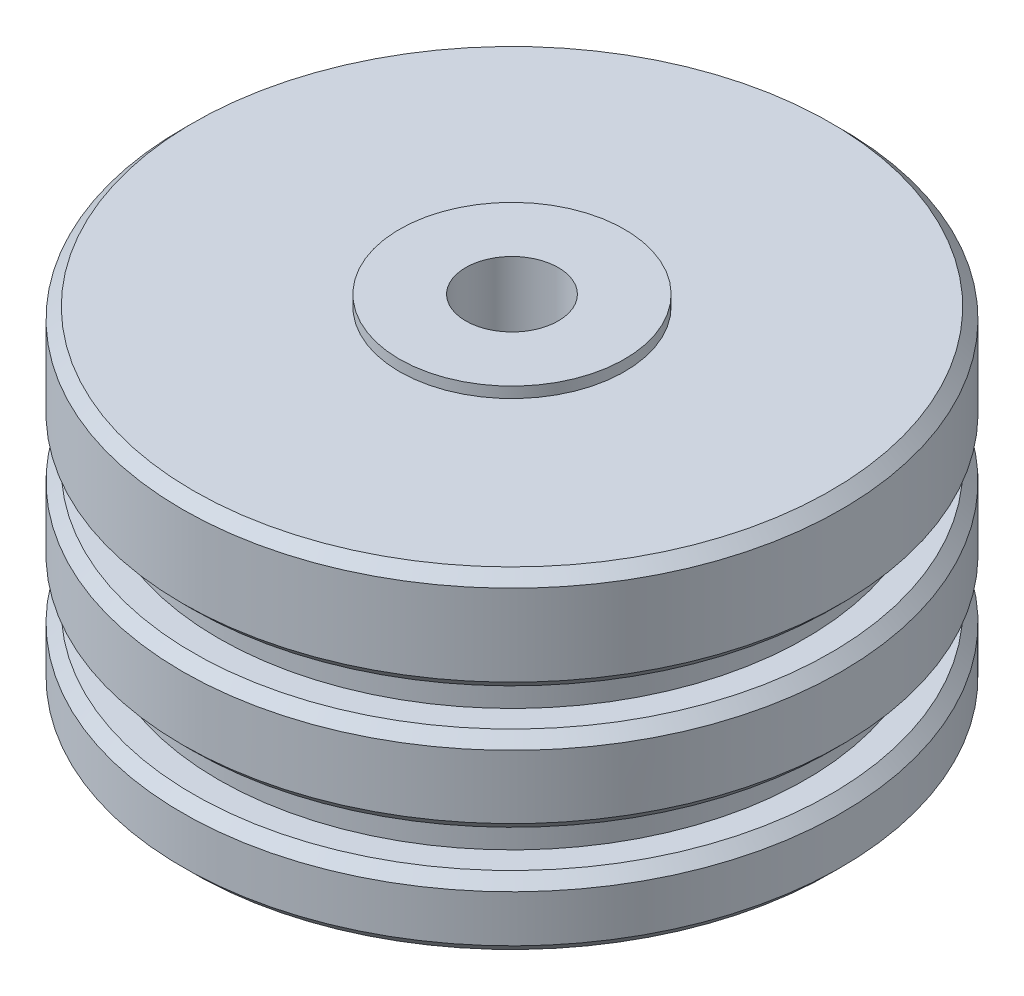
ISO-10303-21;
HEADER;
FILE_DESCRIPTION(('STEP AP214'),'2;1');
FILE_NAME('part.step','',(''),(''),'','','');
FILE_SCHEMA(('AUTOMOTIVE_DESIGN { 1 0 10303 214 1 1 1 1 }'));
ENDSEC;
DATA;
#1=APPLICATION_CONTEXT('core data for automotive mechanical design processes');
#2=APPLICATION_PROTOCOL_DEFINITION('international standard','automotive_design',2000,#1);
#3=PRODUCT_CONTEXT('',#1,'mechanical');
#4=PRODUCT('Part','Part','',(#3));
#5=PRODUCT_RELATED_PRODUCT_CATEGORY('part','',(#4));
#6=PRODUCT_DEFINITION_FORMATION('','',#4);
#7=PRODUCT_DEFINITION_CONTEXT('part definition',#1,'design');
#8=PRODUCT_DEFINITION('design','',#6,#7);
#9=PRODUCT_DEFINITION_SHAPE('','',#8);
#10=(LENGTH_UNIT() NAMED_UNIT(*) SI_UNIT(.MILLI.,.METRE.));
#11=(NAMED_UNIT(*) PLANE_ANGLE_UNIT() SI_UNIT($,.RADIAN.));
#12=(NAMED_UNIT(*) SI_UNIT($,.STERADIAN.) SOLID_ANGLE_UNIT());
#13=UNCERTAINTY_MEASURE_WITH_UNIT(LENGTH_MEASURE(1.E-05),#10,'distance_accuracy_value','');
#14=(GEOMETRIC_REPRESENTATION_CONTEXT(3) GLOBAL_UNCERTAINTY_ASSIGNED_CONTEXT((#13)) GLOBAL_UNIT_ASSIGNED_CONTEXT((#10,
#11,#12)) REPRESENTATION_CONTEXT('',''));
#15=CARTESIAN_POINT('',(0.,0.,0.));
#16=DIRECTION('',(0.,0.,1.));
#17=DIRECTION('',(1.,0.,0.));
#18=AXIS2_PLACEMENT_3D('',#15,#16,#17);
#19=CARTESIAN_POINT('',(0.,24.892,0.));
#20=DIRECTION('',(0.,1.,0.));
#21=DIRECTION('',(0.,0.,1.));
#22=AXIS2_PLACEMENT_3D('',#19,#20,#21);
#23=CYLINDRICAL_SURFACE('',#22,7.9375);
#24=CARTESIAN_POINT('',(0.,0.,0.));
#25=DIRECTION('',(0.,1.,0.));
#26=DIRECTION('',(0.,0.,1.));
#27=AXIS2_PLACEMENT_3D('',#24,#25,#26);
#28=CIRCLE('',#27,7.9375);
#29=CARTESIAN_POINT('',(0.,0.,7.9375));
#30=VERTEX_POINT('',#29);
#31=EDGE_CURVE('E98',#30,#30,#28,.T.);
#32=ORIENTED_EDGE('',*,*,#31,.T.);
#33=EDGE_LOOP('',(#32));
#34=FACE_BOUND('',#33,.T.);
#35=CARTESIAN_POINT('',(0.,0.761999999999999,0.));
#36=DIRECTION('',(0.,1.,0.));
#37=DIRECTION('',(0.,0.,1.));
#38=AXIS2_PLACEMENT_3D('',#35,#36,#37);
#39=CIRCLE('',#38,7.9375);
#40=CARTESIAN_POINT('',(0.,0.761999999999999,7.9375));
#41=VERTEX_POINT('',#40);
#42=EDGE_CURVE('E77',#41,#41,#39,.T.);
#43=ORIENTED_EDGE('',*,*,#42,.F.);
#44=EDGE_LOOP('',(#43));
#45=FACE_BOUND('',#44,.T.);
#46=ADVANCED_FACE('F33',(#34,#45),#23,.T.);
#47=CARTESIAN_POINT('',(0.,0.761999999999999,0.));
#48=DIRECTION('',(0.,-1.,0.));
#49=DIRECTION('',(0.,0.,-1.));
#50=AXIS2_PLACEMENT_3D('',#47,#48,#49);
#51=PLANE('',#50);
#52=CARTESIAN_POINT('',(0.,0.761999999999999,0.));
#53=DIRECTION('',(0.,-1.,0.));
#54=DIRECTION('',(0.,0.,-1.));
#55=AXIS2_PLACEMENT_3D('',#52,#53,#54);
#56=CIRCLE('',#55,22.479);
#57=CARTESIAN_POINT('',(0.,0.761999999999999,-22.479));
#58=VERTEX_POINT('',#57);
#59=EDGE_CURVE('E68',#58,#58,#56,.T.);
#60=ORIENTED_EDGE('',*,*,#59,.T.);
#61=EDGE_LOOP('',(#60));
#62=FACE_BOUND('',#61,.T.);
#63=ORIENTED_EDGE('',*,*,#42,.T.);
#64=EDGE_LOOP('',(#63));
#65=FACE_BOUND('',#64,.T.);
#66=ADVANCED_FACE('F128',(#62,#65),#51,.T.);
#67=CARTESIAN_POINT('',(0.,24.892,0.));
#68=DIRECTION('',(0.,1.,0.));
#69=DIRECTION('',(0.,0.,1.));
#70=AXIS2_PLACEMENT_3D('',#67,#68,#69);
#71=CYLINDRICAL_SURFACE('',#70,23.241);
#72=CARTESIAN_POINT('',(0.,1.52399999999999,0.));
#73=DIRECTION('',(0.,-1.,0.));
#74=DIRECTION('',(0.,0.,-1.));
#75=AXIS2_PLACEMENT_3D('',#72,#73,#74);
#76=CIRCLE('',#75,23.241);
#77=CARTESIAN_POINT('',(0.,1.52399999999999,-23.241));
#78=VERTEX_POINT('',#77);
#79=EDGE_CURVE('E71',#78,#78,#76,.F.);
#80=ORIENTED_EDGE('',*,*,#79,.T.);
#81=EDGE_LOOP('',(#80));
#82=FACE_BOUND('',#81,.T.);
#83=CARTESIAN_POINT('',(0.,4.826,0.));
#84=DIRECTION('',(0.,-1.,0.));
#85=DIRECTION('',(0.,0.,-1.));
#86=AXIS2_PLACEMENT_3D('',#83,#84,#85);
#87=CIRCLE('',#86,23.241);
#88=CARTESIAN_POINT('',(0.,4.826,-23.241));
#89=VERTEX_POINT('',#88);
#90=EDGE_CURVE('E74',#89,#89,#87,.T.);
#91=ORIENTED_EDGE('',*,*,#90,.T.);
#92=EDGE_LOOP('',(#91));
#93=FACE_BOUND('',#92,.T.);
#94=ADVANCED_FACE('F134',(#82,#93),#71,.T.);
#95=CARTESIAN_POINT('',(0.,5.588,0.));
#96=DIRECTION('',(0.,-1.,0.));
#97=DIRECTION('',(0.,0.,-1.));
#98=AXIS2_PLACEMENT_3D('',#95,#96,#97);
#99=PLANE('',#98);
#100=CARTESIAN_POINT('',(0.,5.588,0.));
#101=DIRECTION('',(0.,-1.,0.));
#102=DIRECTION('',(0.,0.,-1.));
#103=AXIS2_PLACEMENT_3D('',#100,#101,#102);
#104=CIRCLE('',#103,22.479);
#105=CARTESIAN_POINT('',(0.,5.588,-22.479));
#106=VERTEX_POINT('',#105);
#107=EDGE_CURVE('E65',#106,#106,#104,.F.);
#108=ORIENTED_EDGE('',*,*,#107,.T.);
#109=EDGE_LOOP('',(#108));
#110=FACE_BOUND('',#109,.T.);
#111=CARTESIAN_POINT('',(0.,5.588,0.));
#112=DIRECTION('',(0.,1.,0.));
#113=DIRECTION('',(0.,0.,1.));
#114=AXIS2_PLACEMENT_3D('',#111,#112,#113);
#115=CIRCLE('',#114,20.701);
#116=CARTESIAN_POINT('',(0.,5.588,20.701));
#117=VERTEX_POINT('',#116);
#118=EDGE_CURVE('E80',#117,#117,#115,.T.);
#119=ORIENTED_EDGE('',*,*,#118,.F.);
#120=EDGE_LOOP('',(#119));
#121=FACE_BOUND('',#120,.T.);
#122=ADVANCED_FACE('F195',(#110,#121),#99,.F.);
#123=CARTESIAN_POINT('',(0.,24.892,0.));
#124=DIRECTION('',(0.,1.,0.));
#125=DIRECTION('',(0.,0.,1.));
#126=AXIS2_PLACEMENT_3D('',#123,#124,#125);
#127=CYLINDRICAL_SURFACE('',#126,20.701);
#128=CARTESIAN_POINT('',(0.,8.226800031,0.));
#129=DIRECTION('',(0.,1.,0.));
#130=DIRECTION('',(0.,0.,1.));
#131=AXIS2_PLACEMENT_3D('',#128,#129,#130);
#132=CIRCLE('',#131,20.701);
#133=CARTESIAN_POINT('',(0.,8.226800031,20.701));
#134=VERTEX_POINT('',#133);
#135=EDGE_CURVE('E83',#134,#134,#132,.T.);
#136=ORIENTED_EDGE('',*,*,#135,.F.);
#137=EDGE_LOOP('',(#136));
#138=FACE_BOUND('',#137,.T.);
#139=ORIENTED_EDGE('',*,*,#118,.T.);
#140=EDGE_LOOP('',(#139));
#141=FACE_BOUND('',#140,.T.);
#142=ADVANCED_FACE('F191',(#138,#141),#127,.T.);
#143=CARTESIAN_POINT('',(0.,8.226800031,0.));
#144=DIRECTION('',(0.,1.,0.));
#145=DIRECTION('',(0.,0.,1.));
#146=AXIS2_PLACEMENT_3D('',#143,#144,#145);
#147=PLANE('',#146);
#148=CARTESIAN_POINT('',(0.,8.226800031,0.));
#149=DIRECTION('',(0.,1.,0.));
#150=DIRECTION('',(0.,0.,1.));
#151=AXIS2_PLACEMENT_3D('',#148,#149,#150);
#152=CIRCLE('',#151,22.479);
#153=CARTESIAN_POINT('',(0.,8.226800031,22.479));
#154=VERTEX_POINT('',#153);
#155=EDGE_CURVE('E56',#154,#154,#152,.F.);
#156=ORIENTED_EDGE('',*,*,#155,.T.);
#157=EDGE_LOOP('',(#156));
#158=FACE_BOUND('',#157,.T.);
#159=ORIENTED_EDGE('',*,*,#135,.T.);
#160=EDGE_LOOP('',(#159));
#161=FACE_BOUND('',#160,.T.);
#162=ADVANCED_FACE('F187',(#158,#161),#147,.F.);
#163=CARTESIAN_POINT('',(0.,24.892,0.));
#164=DIRECTION('',(0.,1.,0.));
#165=DIRECTION('',(0.,0.,1.));
#166=AXIS2_PLACEMENT_3D('',#163,#164,#165);
#167=CYLINDRICAL_SURFACE('',#166,23.241);
#168=CARTESIAN_POINT('',(0.,8.98880003100001,0.));
#169=DIRECTION('',(0.,1.,0.));
#170=DIRECTION('',(0.,0.,1.));
#171=AXIS2_PLACEMENT_3D('',#168,#169,#170);
#172=CIRCLE('',#171,23.241);
#173=CARTESIAN_POINT('',(0.,8.98880003100001,23.241));
#174=VERTEX_POINT('',#173);
#175=EDGE_CURVE('E59',#174,#174,#172,.T.);
#176=ORIENTED_EDGE('',*,*,#175,.T.);
#177=EDGE_LOOP('',(#176));
#178=FACE_BOUND('',#177,.T.);
#179=CARTESIAN_POINT('',(0.,13.464799969,0.));
#180=DIRECTION('',(0.,-1.,0.));
#181=DIRECTION('',(0.,0.,-1.));
#182=AXIS2_PLACEMENT_3D('',#179,#180,#181);
#183=CIRCLE('',#182,23.241);
#184=CARTESIAN_POINT('',(0.,13.464799969,-23.241));
#185=VERTEX_POINT('',#184);
#186=EDGE_CURVE('E62',#185,#185,#183,.T.);
#187=ORIENTED_EDGE('',*,*,#186,.T.);
#188=EDGE_LOOP('',(#187));
#189=FACE_BOUND('',#188,.T.);
#190=ADVANCED_FACE('F183',(#178,#189),#167,.T.);
#191=CARTESIAN_POINT('',(0.,14.226799969,0.));
#192=DIRECTION('',(0.,-1.,0.));
#193=DIRECTION('',(0.,0.,-1.));
#194=AXIS2_PLACEMENT_3D('',#191,#192,#193);
#195=PLANE('',#194);
#196=CARTESIAN_POINT('',(0.,14.226799969,0.));
#197=DIRECTION('',(0.,-1.,0.));
#198=DIRECTION('',(0.,0.,-1.));
#199=AXIS2_PLACEMENT_3D('',#196,#197,#198);
#200=CIRCLE('',#199,22.479);
#201=CARTESIAN_POINT('',(0.,14.226799969,-22.479));
#202=VERTEX_POINT('',#201);
#203=EDGE_CURVE('E53',#202,#202,#200,.F.);
#204=ORIENTED_EDGE('',*,*,#203,.T.);
#205=EDGE_LOOP('',(#204));
#206=FACE_BOUND('',#205,.T.);
#207=CARTESIAN_POINT('',(0.,14.226799969,0.));
#208=DIRECTION('',(0.,1.,0.));
#209=DIRECTION('',(0.,0.,1.));
#210=AXIS2_PLACEMENT_3D('',#207,#208,#209);
#211=CIRCLE('',#210,20.701);
#212=CARTESIAN_POINT('',(0.,14.226799969,20.701));
#213=VERTEX_POINT('',#212);
#214=EDGE_CURVE('E86',#213,#213,#211,.T.);
#215=ORIENTED_EDGE('',*,*,#214,.F.);
#216=EDGE_LOOP('',(#215));
#217=FACE_BOUND('',#216,.T.);
#218=ADVANCED_FACE('F179',(#206,#217),#195,.F.);
#219=CARTESIAN_POINT('',(0.,24.892,0.));
#220=DIRECTION('',(0.,1.,0.));
#221=DIRECTION('',(0.,0.,1.));
#222=AXIS2_PLACEMENT_3D('',#219,#220,#221);
#223=CYLINDRICAL_SURFACE('',#222,20.701);
#224=CARTESIAN_POINT('',(0.,16.8656,0.));
#225=DIRECTION('',(0.,1.,0.));
#226=DIRECTION('',(0.,0.,1.));
#227=AXIS2_PLACEMENT_3D('',#224,#225,#226);
#228=CIRCLE('',#227,20.701);
#229=CARTESIAN_POINT('',(0.,16.8656,20.701));
#230=VERTEX_POINT('',#229);
#231=EDGE_CURVE('E89',#230,#230,#228,.T.);
#232=ORIENTED_EDGE('',*,*,#231,.F.);
#233=EDGE_LOOP('',(#232));
#234=FACE_BOUND('',#233,.T.);
#235=ORIENTED_EDGE('',*,*,#214,.T.);
#236=EDGE_LOOP('',(#235));
#237=FACE_BOUND('',#236,.T.);
#238=ADVANCED_FACE('F174',(#234,#237),#223,.T.);
#239=CARTESIAN_POINT('',(0.,16.8656,0.));
#240=DIRECTION('',(0.,1.,0.));
#241=DIRECTION('',(0.,0.,1.));
#242=AXIS2_PLACEMENT_3D('',#239,#240,#241);
#243=PLANE('',#242);
#244=CARTESIAN_POINT('',(0.,16.8656,0.));
#245=DIRECTION('',(0.,1.,0.));
#246=DIRECTION('',(0.,0.,1.));
#247=AXIS2_PLACEMENT_3D('',#244,#245,#246);
#248=CIRCLE('',#247,22.479);
#249=CARTESIAN_POINT('',(0.,16.8656,22.479));
#250=VERTEX_POINT('',#249);
#251=EDGE_CURVE('E40',#250,#250,#248,.F.);
#252=ORIENTED_EDGE('',*,*,#251,.T.);
#253=EDGE_LOOP('',(#252));
#254=FACE_BOUND('',#253,.T.);
#255=ORIENTED_EDGE('',*,*,#231,.T.);
#256=EDGE_LOOP('',(#255));
#257=FACE_BOUND('',#256,.T.);
#258=ADVANCED_FACE('F167',(#254,#257),#243,.F.);
#259=CARTESIAN_POINT('',(0.,24.892,0.));
#260=DIRECTION('',(0.,1.,0.));
#261=DIRECTION('',(0.,0.,1.));
#262=AXIS2_PLACEMENT_3D('',#259,#260,#261);
#263=CYLINDRICAL_SURFACE('',#262,23.241);
#264=CARTESIAN_POINT('',(0.,17.6276,0.));
#265=DIRECTION('',(0.,1.,0.));
#266=DIRECTION('',(0.,0.,1.));
#267=AXIS2_PLACEMENT_3D('',#264,#265,#266);
#268=CIRCLE('',#267,23.241);
#269=CARTESIAN_POINT('',(0.,17.6276,23.241));
#270=VERTEX_POINT('',#269);
#271=EDGE_CURVE('E44',#270,#270,#268,.T.);
#272=ORIENTED_EDGE('',*,*,#271,.T.);
#273=EDGE_LOOP('',(#272));
#274=FACE_BOUND('',#273,.T.);
#275=CARTESIAN_POINT('',(0.,23.368,0.));
#276=DIRECTION('',(0.,1.,0.));
#277=DIRECTION('',(0.,0.,1.));
#278=AXIS2_PLACEMENT_3D('',#275,#276,#277);
#279=CIRCLE('',#278,23.241);
#280=CARTESIAN_POINT('',(0.,23.368,23.241));
#281=VERTEX_POINT('',#280);
#282=EDGE_CURVE('E48',#281,#281,#279,.F.);
#283=ORIENTED_EDGE('',*,*,#282,.T.);
#284=EDGE_LOOP('',(#283));
#285=FACE_BOUND('',#284,.T.);
#286=ADVANCED_FACE('F125',(#274,#285),#263,.T.);
#287=CARTESIAN_POINT('',(0.,24.13,0.));
#288=DIRECTION('',(0.,1.,0.));
#289=DIRECTION('',(0.,0.,1.));
#290=AXIS2_PLACEMENT_3D('',#287,#288,#289);
#291=PLANE('',#290);
#292=CARTESIAN_POINT('',(0.,24.13,0.));
#293=DIRECTION('',(0.,1.,0.));
#294=DIRECTION('',(0.,0.,1.));
#295=AXIS2_PLACEMENT_3D('',#292,#293,#294);
#296=CIRCLE('',#295,22.479);
#297=CARTESIAN_POINT('',(0.,24.13,22.479));
#298=VERTEX_POINT('',#297);
#299=EDGE_CURVE('E10',#298,#298,#296,.T.);
#300=ORIENTED_EDGE('',*,*,#299,.T.);
#301=EDGE_LOOP('',(#300));
#302=FACE_BOUND('',#301,.T.);
#303=CARTESIAN_POINT('',(0.,24.13,0.));
#304=DIRECTION('',(0.,1.,0.));
#305=DIRECTION('',(0.,0.,1.));
#306=AXIS2_PLACEMENT_3D('',#303,#304,#305);
#307=CIRCLE('',#306,7.9375);
#308=CARTESIAN_POINT('',(0.,24.13,7.9375));
#309=VERTEX_POINT('',#308);
#310=EDGE_CURVE('E92',#309,#309,#307,.T.);
#311=ORIENTED_EDGE('',*,*,#310,.F.);
#312=EDGE_LOOP('',(#311));
#313=FACE_BOUND('',#312,.T.);
#314=ADVANCED_FACE('F119',(#302,#313),#291,.T.);
#315=CARTESIAN_POINT('',(0.,24.892,0.));
#316=DIRECTION('',(0.,1.,0.));
#317=DIRECTION('',(0.,0.,1.));
#318=AXIS2_PLACEMENT_3D('',#315,#316,#317);
#319=CYLINDRICAL_SURFACE('',#318,7.9375);
#320=ORIENTED_EDGE('',*,*,#310,.T.);
#321=EDGE_LOOP('',(#320));
#322=FACE_BOUND('',#321,.T.);
#323=CARTESIAN_POINT('',(0.,24.892,0.));
#324=DIRECTION('',(0.,1.,0.));
#325=DIRECTION('',(0.,0.,1.));
#326=AXIS2_PLACEMENT_3D('',#323,#324,#325);
#327=CIRCLE('',#326,7.9375);
#328=CARTESIAN_POINT('',(0.,24.892,7.9375));
#329=VERTEX_POINT('',#328);
#330=EDGE_CURVE('E95',#329,#329,#327,.T.);
#331=ORIENTED_EDGE('',*,*,#330,.F.);
#332=EDGE_LOOP('',(#331));
#333=FACE_BOUND('',#332,.T.);
#334=ADVANCED_FACE('F114',(#322,#333),#319,.T.);
#335=CARTESIAN_POINT('',(0.,24.892,0.));
#336=DIRECTION('',(0.,-1.,0.));
#337=DIRECTION('',(0.,0.,-1.));
#338=AXIS2_PLACEMENT_3D('',#335,#336,#337);
#339=PLANE('',#338);
#340=CARTESIAN_POINT('',(0.,24.892,0.));
#341=DIRECTION('',(0.,1.,0.));
#342=DIRECTION('',(0.,0.,1.));
#343=AXIS2_PLACEMENT_3D('',#340,#341,#342);
#344=CIRCLE('',#343,3.26389999999999);
#345=CARTESIAN_POINT('',(0.,24.892,3.26389999999999));
#346=VERTEX_POINT('',#345);
#347=EDGE_CURVE('E104',#346,#346,#344,.T.);
#348=ORIENTED_EDGE('',*,*,#347,.F.);
#349=EDGE_LOOP('',(#348));
#350=FACE_BOUND('',#349,.T.);
#351=ORIENTED_EDGE('',*,*,#330,.T.);
#352=EDGE_LOOP('',(#351));
#353=FACE_BOUND('',#352,.T.);
#354=ADVANCED_FACE('F110',(#350,#353),#339,.F.);
#355=CARTESIAN_POINT('',(0.,0.,0.));
#356=DIRECTION('',(0.,1.,0.));
#357=DIRECTION('',(0.,0.,1.));
#358=AXIS2_PLACEMENT_3D('',#355,#356,#357);
#359=PLANE('',#358);
#360=CARTESIAN_POINT('',(0.,0.,0.));
#361=DIRECTION('',(0.,1.,0.));
#362=DIRECTION('',(0.,0.,1.));
#363=AXIS2_PLACEMENT_3D('',#360,#361,#362);
#364=CIRCLE('',#363,3.26389999999999);
#365=CARTESIAN_POINT('',(0.,0.,3.26389999999999));
#366=VERTEX_POINT('',#365);
#367=EDGE_CURVE('E101',#366,#366,#364,.T.);
#368=ORIENTED_EDGE('',*,*,#367,.T.);
#369=EDGE_LOOP('',(#368));
#370=FACE_BOUND('',#369,.T.);
#371=ORIENTED_EDGE('',*,*,#31,.F.);
#372=EDGE_LOOP('',(#371));
#373=FACE_BOUND('',#372,.T.);
#374=ADVANCED_FACE('F113',(#370,#373),#359,.F.);
#375=CARTESIAN_POINT('',(0.,24.892,0.));
#376=DIRECTION('',(0.,1.,0.));
#377=DIRECTION('',(0.,0.,1.));
#378=AXIS2_PLACEMENT_3D('',#375,#376,#377);
#379=CYLINDRICAL_SURFACE('',#378,3.26389999999999);
#380=ORIENTED_EDGE('',*,*,#367,.F.);
#381=EDGE_LOOP('',(#380));
#382=FACE_BOUND('',#381,.T.);
#383=ORIENTED_EDGE('',*,*,#347,.T.);
#384=EDGE_LOOP('',(#383));
#385=FACE_BOUND('',#384,.T.);
#386=ADVANCED_FACE('F108',(#382,#385),#379,.F.);
#387=CARTESIAN_POINT('',(0.,1.52399999999999,0.));
#388=DIRECTION('',(0.,1.,0.));
#389=DIRECTION('',(0.,0.,1.));
#390=AXIS2_PLACEMENT_3D('',#387,#388,#389);
#391=CONICAL_SURFACE('',#390,23.241,0.785398163397448);
#392=ORIENTED_EDGE('',*,*,#59,.F.);
#393=EDGE_LOOP('',(#392));
#394=FACE_BOUND('',#393,.T.);
#395=ORIENTED_EDGE('',*,*,#79,.F.);
#396=EDGE_LOOP('',(#395));
#397=FACE_BOUND('',#396,.T.);
#398=ADVANCED_FACE('F140',(#394,#397),#391,.T.);
#399=CARTESIAN_POINT('',(0.,5.588,0.));
#400=DIRECTION('',(0.,-1.,0.));
#401=DIRECTION('',(0.,0.,-1.));
#402=AXIS2_PLACEMENT_3D('',#399,#400,#401);
#403=CONICAL_SURFACE('',#402,22.479,0.785398163397448);
#404=ORIENTED_EDGE('',*,*,#90,.F.);
#405=EDGE_LOOP('',(#404));
#406=FACE_BOUND('',#405,.T.);
#407=ORIENTED_EDGE('',*,*,#107,.F.);
#408=EDGE_LOOP('',(#407));
#409=FACE_BOUND('',#408,.T.);
#410=ADVANCED_FACE('F143',(#406,#409),#403,.T.);
#411=CARTESIAN_POINT('',(0.,8.98880003100001,0.));
#412=DIRECTION('',(0.,1.,0.));
#413=DIRECTION('',(0.,0.,1.));
#414=AXIS2_PLACEMENT_3D('',#411,#412,#413);
#415=CONICAL_SURFACE('',#414,23.241,0.785398163397453);
#416=ORIENTED_EDGE('',*,*,#155,.F.);
#417=EDGE_LOOP('',(#416));
#418=FACE_BOUND('',#417,.T.);
#419=ORIENTED_EDGE('',*,*,#175,.F.);
#420=EDGE_LOOP('',(#419));
#421=FACE_BOUND('',#420,.T.);
#422=ADVANCED_FACE('F147',(#418,#421),#415,.T.);
#423=CARTESIAN_POINT('',(0.,14.226799969,0.));
#424=DIRECTION('',(0.,-1.,0.));
#425=DIRECTION('',(0.,0.,-1.));
#426=AXIS2_PLACEMENT_3D('',#423,#424,#425);
#427=CONICAL_SURFACE('',#426,22.479,0.785398163397448);
#428=ORIENTED_EDGE('',*,*,#186,.F.);
#429=EDGE_LOOP('',(#428));
#430=FACE_BOUND('',#429,.T.);
#431=ORIENTED_EDGE('',*,*,#203,.F.);
#432=EDGE_LOOP('',(#431));
#433=FACE_BOUND('',#432,.T.);
#434=ADVANCED_FACE('F151',(#430,#433),#427,.T.);
#435=CARTESIAN_POINT('',(0.,17.6276,0.));
#436=DIRECTION('',(0.,1.,0.));
#437=DIRECTION('',(0.,0.,1.));
#438=AXIS2_PLACEMENT_3D('',#435,#436,#437);
#439=CONICAL_SURFACE('',#438,23.241,0.785398163397453);
#440=ORIENTED_EDGE('',*,*,#251,.F.);
#441=EDGE_LOOP('',(#440));
#442=FACE_BOUND('',#441,.T.);
#443=ORIENTED_EDGE('',*,*,#271,.F.);
#444=EDGE_LOOP('',(#443));
#445=FACE_BOUND('',#444,.T.);
#446=ADVANCED_FACE('F154',(#442,#445),#439,.T.);
#447=CARTESIAN_POINT('',(0.,24.13,0.));
#448=DIRECTION('',(0.,-1.,0.));
#449=DIRECTION('',(0.,0.,-1.));
#450=AXIS2_PLACEMENT_3D('',#447,#448,#449);
#451=CONICAL_SURFACE('',#450,22.479,0.785398163397448);
#452=ORIENTED_EDGE('',*,*,#282,.F.);
#453=EDGE_LOOP('',(#452));
#454=FACE_BOUND('',#453,.T.);
#455=ORIENTED_EDGE('',*,*,#299,.F.);
#456=EDGE_LOOP('',(#455));
#457=FACE_BOUND('',#456,.T.);
#458=ADVANCED_FACE('F35',(#454,#457),#451,.T.);
#459=CLOSED_SHELL('',(#46,#66,#94,#122,#142,#162,#190,#218,#238,#258,#286,#314,#334,#354,#374,
#386,#398,#410,#422,#434,#446,#458));
#460=MANIFOLD_SOLID_BREP('B2',#459);
#461=ADVANCED_BREP_SHAPE_REPRESENTATION('',(#18,#460),#14);
#462=SHAPE_DEFINITION_REPRESENTATION(#9,#461);
ENDSEC;
END-ISO-10303-21;
